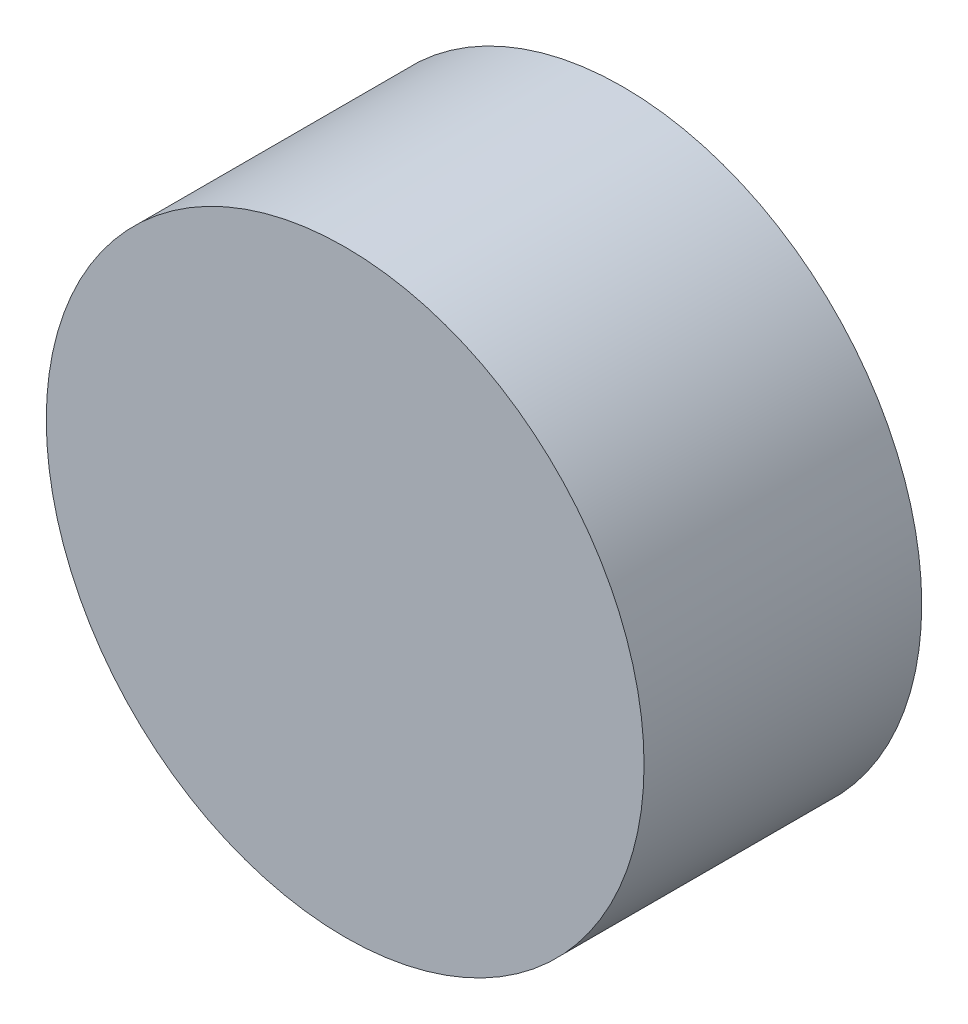
ISO-10303-21;
HEADER;
FILE_DESCRIPTION(('STEP AP214'),'2;1');
FILE_NAME('part.step','',(''),(''),'','','');
FILE_SCHEMA(('AUTOMOTIVE_DESIGN { 1 0 10303 214 1 1 1 1 }'));
ENDSEC;
DATA;
#1=APPLICATION_CONTEXT('core data for automotive mechanical design processes');
#2=APPLICATION_PROTOCOL_DEFINITION('international standard','automotive_design',2000,#1);
#3=PRODUCT_CONTEXT('',#1,'mechanical');
#4=PRODUCT('Part','Part','',(#3));
#5=PRODUCT_RELATED_PRODUCT_CATEGORY('part','',(#4));
#6=PRODUCT_DEFINITION_FORMATION('','',#4);
#7=PRODUCT_DEFINITION_CONTEXT('part definition',#1,'design');
#8=PRODUCT_DEFINITION('design','',#6,#7);
#9=PRODUCT_DEFINITION_SHAPE('','',#8);
#10=(LENGTH_UNIT() NAMED_UNIT(*) SI_UNIT(.MILLI.,.METRE.));
#11=(NAMED_UNIT(*) PLANE_ANGLE_UNIT() SI_UNIT($,.RADIAN.));
#12=(NAMED_UNIT(*) SI_UNIT($,.STERADIAN.) SOLID_ANGLE_UNIT());
#13=UNCERTAINTY_MEASURE_WITH_UNIT(LENGTH_MEASURE(1.E-05),#10,'distance_accuracy_value','');
#14=(GEOMETRIC_REPRESENTATION_CONTEXT(3) GLOBAL_UNCERTAINTY_ASSIGNED_CONTEXT((#13)) GLOBAL_UNIT_ASSIGNED_CONTEXT((#10,
#11,#12)) REPRESENTATION_CONTEXT('',''));
#15=CARTESIAN_POINT('',(0.,0.,0.));
#16=DIRECTION('',(0.,0.,1.));
#17=DIRECTION('',(1.,0.,0.));
#18=AXIS2_PLACEMENT_3D('',#15,#16,#17);
#19=CARTESIAN_POINT('',(0.,0.,28.575));
#20=DIRECTION('',(0.,0.,-1.));
#21=DIRECTION('',(-1.,0.,0.));
#22=AXIS2_PLACEMENT_3D('',#19,#20,#21);
#23=CYLINDRICAL_SURFACE('',#22,30.7594);
#24=CARTESIAN_POINT('',(0.,0.,28.575));
#25=DIRECTION('',(0.,0.,1.));
#26=DIRECTION('',(1.,0.,0.));
#27=AXIS2_PLACEMENT_3D('',#24,#25,#26);
#28=CIRCLE('',#27,30.7594);
#29=CARTESIAN_POINT('',(30.7594,0.,28.575));
#30=VERTEX_POINT('',#29);
#31=EDGE_CURVE('E10',#30,#30,#28,.T.);
#32=ORIENTED_EDGE('',*,*,#31,.F.);
#33=EDGE_LOOP('',(#32));
#34=FACE_BOUND('',#33,.T.);
#35=CARTESIAN_POINT('',(0.,0.,0.));
#36=DIRECTION('',(0.,0.,1.));
#37=DIRECTION('',(1.,0.,0.));
#38=AXIS2_PLACEMENT_3D('',#35,#36,#37);
#39=CIRCLE('',#38,30.7594);
#40=CARTESIAN_POINT('',(30.7594,0.,0.));
#41=VERTEX_POINT('',#40);
#42=EDGE_CURVE('E35',#41,#41,#39,.T.);
#43=ORIENTED_EDGE('',*,*,#42,.T.);
#44=EDGE_LOOP('',(#43));
#45=FACE_BOUND('',#44,.T.);
#46=ADVANCED_FACE('F32',(#34,#45),#23,.T.);
#47=CARTESIAN_POINT('',(0.,0.,28.575));
#48=DIRECTION('',(0.,0.,1.));
#49=DIRECTION('',(1.,0.,0.));
#50=AXIS2_PLACEMENT_3D('',#47,#48,#49);
#51=PLANE('',#50);
#52=ORIENTED_EDGE('',*,*,#31,.T.);
#53=EDGE_LOOP('',(#52));
#54=FACE_BOUND('',#53,.T.);
#55=ADVANCED_FACE('F47',(#54),#51,.T.);
#56=CARTESIAN_POINT('',(0.,0.,0.));
#57=DIRECTION('',(0.,0.,1.));
#58=DIRECTION('',(1.,0.,0.));
#59=AXIS2_PLACEMENT_3D('',#56,#57,#58);
#60=PLANE('',#59);
#61=ORIENTED_EDGE('',*,*,#42,.F.);
#62=EDGE_LOOP('',(#61));
#63=FACE_BOUND('',#62,.T.);
#64=ADVANCED_FACE('F45',(#63),#60,.F.);
#65=CLOSED_SHELL('',(#46,#55,#64));
#66=MANIFOLD_SOLID_BREP('B2',#65);
#67=ADVANCED_BREP_SHAPE_REPRESENTATION('',(#18,#66),#14);
#68=SHAPE_DEFINITION_REPRESENTATION(#9,#67);
ENDSEC;
END-ISO-10303-21;
